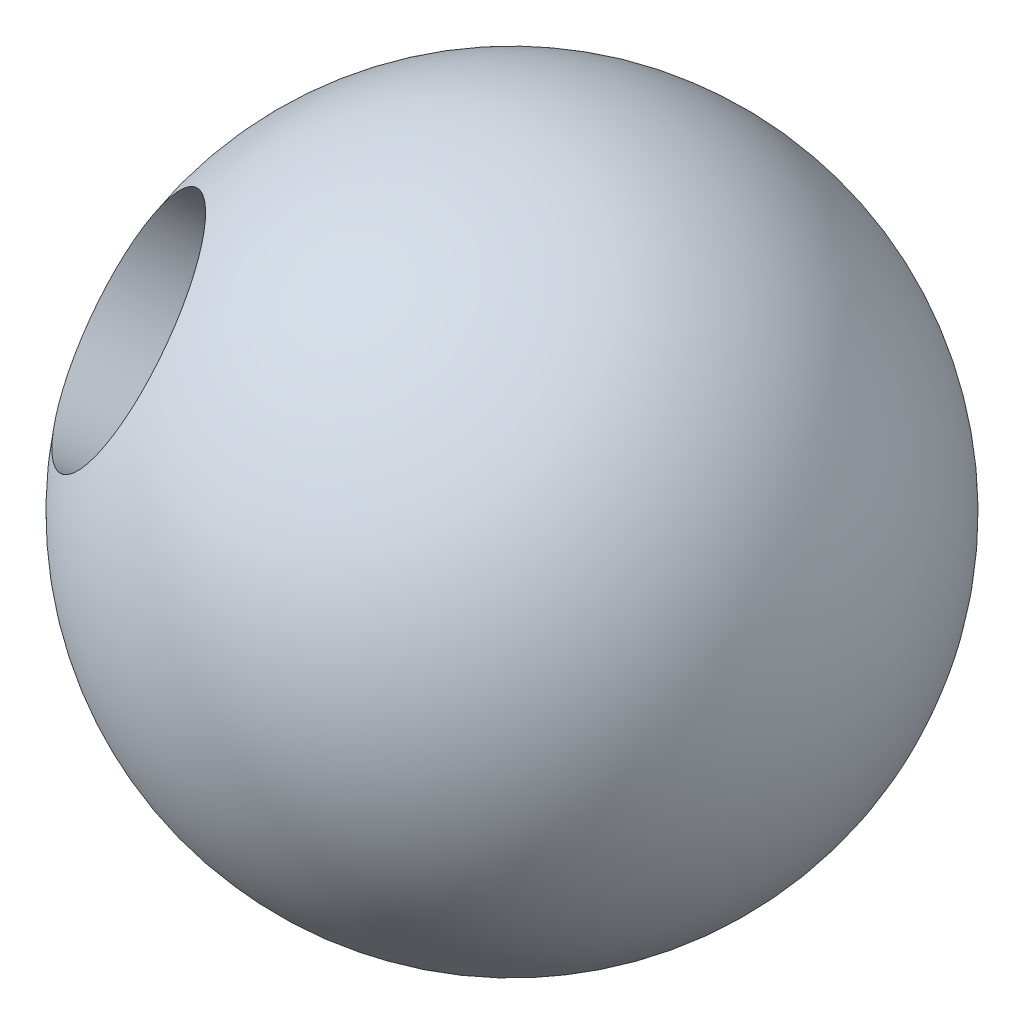
ISO-10303-21;
HEADER;
FILE_DESCRIPTION(('STEP AP214'),'2;1');
FILE_NAME('part.step','',(''),(''),'','','');
FILE_SCHEMA(('AUTOMOTIVE_DESIGN { 1 0 10303 214 1 1 1 1 }'));
ENDSEC;
DATA;
#1=APPLICATION_CONTEXT('core data for automotive mechanical design processes');
#2=APPLICATION_PROTOCOL_DEFINITION('international standard','automotive_design',2000,#1);
#3=PRODUCT_CONTEXT('',#1,'mechanical');
#4=PRODUCT('Part','Part','',(#3));
#5=PRODUCT_RELATED_PRODUCT_CATEGORY('part','',(#4));
#6=PRODUCT_DEFINITION_FORMATION('','',#4);
#7=PRODUCT_DEFINITION_CONTEXT('part definition',#1,'design');
#8=PRODUCT_DEFINITION('design','',#6,#7);
#9=PRODUCT_DEFINITION_SHAPE('','',#8);
#10=(LENGTH_UNIT() NAMED_UNIT(*) SI_UNIT(.MILLI.,.METRE.));
#11=(NAMED_UNIT(*) PLANE_ANGLE_UNIT() SI_UNIT($,.RADIAN.));
#12=(NAMED_UNIT(*) SI_UNIT($,.STERADIAN.) SOLID_ANGLE_UNIT());
#13=UNCERTAINTY_MEASURE_WITH_UNIT(LENGTH_MEASURE(1.E-05),#10,'distance_accuracy_value','');
#14=(GEOMETRIC_REPRESENTATION_CONTEXT(3) GLOBAL_UNCERTAINTY_ASSIGNED_CONTEXT((#13)) GLOBAL_UNIT_ASSIGNED_CONTEXT((#10,
#11,#12)) REPRESENTATION_CONTEXT('',''));
#15=CARTESIAN_POINT('',(0.,0.,0.));
#16=DIRECTION('',(0.,0.,1.));
#17=DIRECTION('',(1.,0.,0.));
#18=AXIS2_PLACEMENT_3D('',#15,#16,#17);
#19=CARTESIAN_POINT('',(0.,0.,0.));
#20=DIRECTION('',(0.,1.,0.));
#21=DIRECTION('',(1.,0.,0.));
#22=AXIS2_PLACEMENT_3D('',#19,#20,#21);
#23=SPHERICAL_SURFACE('',#22,15.);
#24=CARTESIAN_POINT('',(0.,0.,0.));
#25=DIRECTION('',(0.641135804817904,-0.484147467785268,-0.595437745879124));
#26=DIRECTION('',(-0.680510845087257,0.,-0.732738008921761));
#27=AXIS2_PLACEMENT_3D('',#24,#25,#26);
#28=SPHERICAL_SURFACE('',#27,15.);
#29=CARTESIAN_POINT('',(-9.04410627826092,6.82956889959454,8.39947202347937));
#30=DIRECTION('',(0.641135804817904,-0.484147467785268,-0.595437745879123));
#31=DIRECTION('',(-0.680510845087257,0.,-0.732738008921761));
#32=AXIS2_PLACEMENT_3D('',#29,#30,#31);
#33=CIRCLE('',#32,5.09999999999999);
#34=CARTESIAN_POINT('',(-12.5147115882059,6.82956889959454,4.6625081779784));
#35=VERTEX_POINT('',#34);
#36=EDGE_CURVE('E11',#35,#35,#33,.T.);
#37=ORIENTED_EDGE('',*,*,#36,.T.);
#38=EDGE_LOOP('',(#37));
#39=FACE_BOUND('',#38,.T.);
#40=ADVANCED_FACE('F38',(#39),#28,.T.);
#41=CARTESIAN_POINT('',(-9.61703707226856,7.26221201677902,8.93156618818685));
#42=DIRECTION('',(-0.641135804817904,0.484147467785268,0.595437745879123));
#43=DIRECTION('',(0.680510845087257,0.,0.732738008921761));
#44=AXIS2_PLACEMENT_3D('',#41,#42,#43);
#45=CYLINDRICAL_SURFACE('',#44,5.09999999999999);
#46=CARTESIAN_POINT('',(-0.961703707226855,0.726221201677903,0.89315661881869));
#47=DIRECTION('',(-0.641135804817904,0.484147467785268,0.595437745879123));
#48=DIRECTION('',(0.680510845087257,0.,0.732738008921761));
#49=AXIS2_PLACEMENT_3D('',#46,#47,#48);
#50=CIRCLE('',#49,5.09999999999999);
#51=CARTESIAN_POINT('',(2.50890160271815,0.726221201677903,4.63012046431967));
#52=VERTEX_POINT('',#51);
#53=EDGE_CURVE('E44',#52,#52,#50,.T.);
#54=ORIENTED_EDGE('',*,*,#53,.F.);
#55=EDGE_LOOP('',(#54));
#56=FACE_BOUND('',#55,.T.);
#57=ORIENTED_EDGE('',*,*,#36,.F.);
#58=EDGE_LOOP('',(#57));
#59=FACE_BOUND('',#58,.T.);
#60=ADVANCED_FACE('F50',(#56,#59),#45,.F.);
#61=CARTESIAN_POINT('',(-0.961703707226855,0.726221201677903,0.89315661881869));
#62=DIRECTION('',(-0.641135804817904,0.484147467785268,0.595437745879123));
#63=DIRECTION('',(0.680510845087257,0.,0.732738008921761));
#64=AXIS2_PLACEMENT_3D('',#61,#62,#63);
#65=CONICAL_SURFACE('',#64,5.09999999999999,1.02974425867665);
#66=CARTESIAN_POINT('',(1.0029859012476,-0.75739504901192,-0.931496353345971));
#67=VERTEX_POINT('',#66);
#68=VERTEX_LOOP('',#67);
#69=FACE_BOUND('',#68,.T.);
#70=ORIENTED_EDGE('',*,*,#53,.T.);
#71=EDGE_LOOP('',(#70));
#72=FACE_BOUND('',#71,.T.);
#73=ADVANCED_FACE('F47',(#69,#72),#65,.F.);
#74=CLOSED_SHELL('',(#40,#60,#73));
#75=MANIFOLD_SOLID_BREP('B2',#74);
#76=ADVANCED_BREP_SHAPE_REPRESENTATION('',(#18,#75),#14);
#77=SHAPE_DEFINITION_REPRESENTATION(#9,#76);
ENDSEC;
END-ISO-10303-21;
